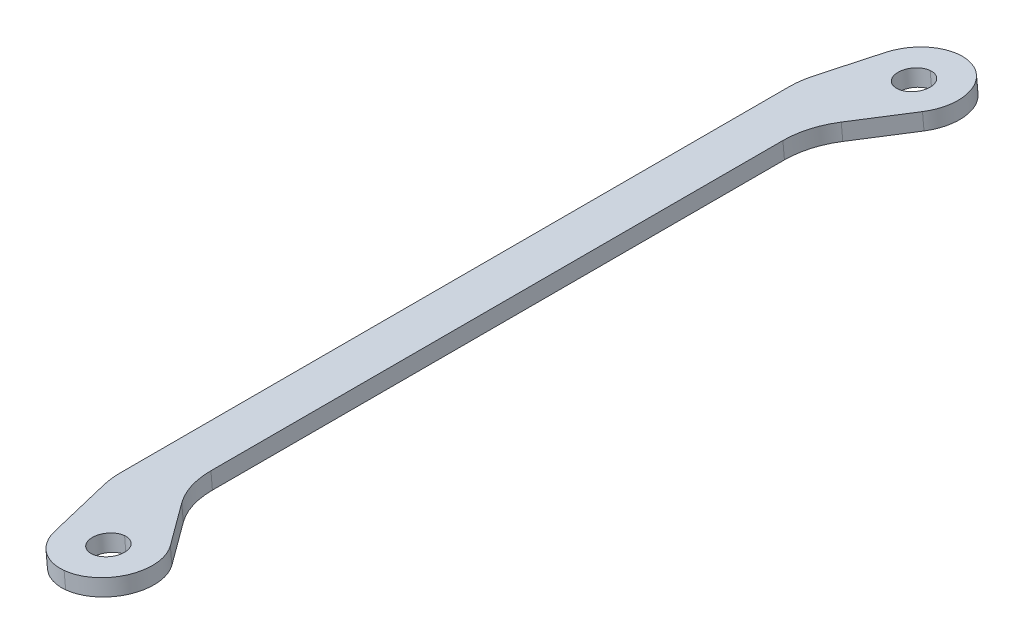
ISO-10303-21;
HEADER;
FILE_DESCRIPTION(('STEP AP214'),'2;1');
FILE_NAME('part.step','',(''),(''),'','','');
FILE_SCHEMA(('AUTOMOTIVE_DESIGN { 1 0 10303 214 1 1 1 1 }'));
ENDSEC;
DATA;
#1=APPLICATION_CONTEXT('core data for automotive mechanical design processes');
#2=APPLICATION_PROTOCOL_DEFINITION('international standard','automotive_design',2000,#1);
#3=PRODUCT_CONTEXT('',#1,'mechanical');
#4=PRODUCT('Part','Part','',(#3));
#5=PRODUCT_RELATED_PRODUCT_CATEGORY('part','',(#4));
#6=PRODUCT_DEFINITION_FORMATION('','',#4);
#7=PRODUCT_DEFINITION_CONTEXT('part definition',#1,'design');
#8=PRODUCT_DEFINITION('design','',#6,#7);
#9=PRODUCT_DEFINITION_SHAPE('','',#8);
#10=(LENGTH_UNIT() NAMED_UNIT(*) SI_UNIT(.MILLI.,.METRE.));
#11=(NAMED_UNIT(*) PLANE_ANGLE_UNIT() SI_UNIT($,.RADIAN.));
#12=(NAMED_UNIT(*) SI_UNIT($,.STERADIAN.) SOLID_ANGLE_UNIT());
#13=UNCERTAINTY_MEASURE_WITH_UNIT(LENGTH_MEASURE(1.E-05),#10,'distance_accuracy_value','');
#14=(GEOMETRIC_REPRESENTATION_CONTEXT(3) GLOBAL_UNCERTAINTY_ASSIGNED_CONTEXT((#13)) GLOBAL_UNIT_ASSIGNED_CONTEXT((#10,
#11,#12)) REPRESENTATION_CONTEXT('',''));
#15=CARTESIAN_POINT('',(0.,0.,0.));
#16=DIRECTION('',(0.,0.,1.));
#17=DIRECTION('',(1.,0.,0.));
#18=AXIS2_PLACEMENT_3D('',#15,#16,#17);
#19=CARTESIAN_POINT('',(104.497536528695,0.153229858228063,83.5835921350063));
#20=DIRECTION('',(0.0958457525245035,-0.995396198366767,0.));
#21=DIRECTION('',(0.,0.,-1.));
#22=AXIS2_PLACEMENT_3D('',#19,#20,#21);
#23=PLANE('',#22);
#24=CARTESIAN_POINT('',(102.086853849795,-0.0788924824399744,-97.9999999999974));
#25=DIRECTION('',(0.0958457525245035,-0.995396198366767,0.));
#26=DIRECTION('',(1.00613961606655E-12,0.,-1.));
#27=AXIS2_PLACEMENT_3D('',#24,#25,#26);
#28=CIRCLE('',#27,4.);
#29=CARTESIAN_POINT('',(102.086853849791,-0.0788924824403613,-93.9999999999974));
#30=VERTEX_POINT('',#29);
#31=CARTESIAN_POINT('',(102.086853849799,-0.0788924824395868,-101.999999999997));
#32=VERTEX_POINT('',#31);
#33=EDGE_CURVE('E257',#30,#32,#28,.T.);
#34=ORIENTED_EDGE('',*,*,#33,.T.);
#35=CARTESIAN_POINT('',(102.086853849795,-0.0788924824399744,-97.9999999999974));
#36=DIRECTION('',(0.0958457525245035,-0.995396198366767,0.));
#37=DIRECTION('',(1.00613961606655E-12,0.,-1.));
#38=AXIS2_PLACEMENT_3D('',#35,#36,#37);
#39=CIRCLE('',#38,4.);
#40=EDGE_CURVE('E11',#32,#30,#39,.T.);
#41=ORIENTED_EDGE('',*,*,#40,.T.);
#42=EDGE_LOOP('',(#34,#41));
#43=FACE_BOUND('',#42,.T.);
#44=CARTESIAN_POINT('',(102.086853849594,-0.07889248245932,102.000000000003));
#45=DIRECTION('',(0.0958457525245035,-0.995396198366767,0.));
#46=DIRECTION('',(1.00613961606655E-12,0.,-1.));
#47=AXIS2_PLACEMENT_3D('',#44,#45,#46);
#48=CIRCLE('',#47,4.);
#49=CARTESIAN_POINT('',(102.08685384959,-0.0788924824597069,106.000000000003));
#50=VERTEX_POINT('',#49);
#51=CARTESIAN_POINT('',(102.086853849598,-0.0788924824589323,98.0000000000026));
#52=VERTEX_POINT('',#51);
#53=EDGE_CURVE('E271',#50,#52,#48,.T.);
#54=ORIENTED_EDGE('',*,*,#53,.T.);
#55=CARTESIAN_POINT('',(102.086853849594,-0.07889248245932,102.000000000003));
#56=DIRECTION('',(0.0958457525245035,-0.995396198366767,0.));
#57=DIRECTION('',(1.00613961606655E-12,0.,-1.));
#58=AXIS2_PLACEMENT_3D('',#55,#56,#57);
#59=CIRCLE('',#58,4.);
#60=EDGE_CURVE('E280',#52,#50,#59,.T.);
#61=ORIENTED_EDGE('',*,*,#60,.T.);
#62=EDGE_LOOP('',(#54,#61));
#63=FACE_BOUND('',#62,.T.);
#64=DIRECTION('',(-0.251701332881661,-0.0242360817743192,-0.967501447733193));
#65=VECTOR('',#64,1.);
#66=CARTESIAN_POINT('',(91.4933339567267,-1.0989324300512,104.781520229074));
#67=LINE('',#66,#65);
#68=CARTESIAN_POINT('',(91.4933339567267,-1.0989324300512,104.781520229074));
#69=VERTEX_POINT('',#68);
#70=CARTESIAN_POINT('',(87.1626857949118,-1.51592641964956,88.1351706916692));
#71=VERTEX_POINT('',#70);
#72=EDGE_CURVE('E261',#69,#71,#67,.T.);
#73=ORIENTED_EDGE('',*,*,#72,.F.);
#74=CARTESIAN_POINT('',(102.086853849594,-0.07889248245932,102.000000000003));
#75=DIRECTION('',(0.0958457525245035,-0.995396198366767,0.));
#76=DIRECTION('',(1.00424719045639E-12,0.,-1.));
#77=AXIS2_PLACEMENT_3D('',#74,#75,#76);
#78=CIRCLE('',#77,11.);
#79=CARTESIAN_POINT('',(102.086853849583,-0.0788924824603834,113.000000000003));
#80=VERTEX_POINT('',#79);
#81=EDGE_CURVE('E249',#80,#69,#78,.T.);
#82=ORIENTED_EDGE('',*,*,#81,.F.);
#83=CARTESIAN_POINT('',(102.086853849594,-0.07889248245932,102.000000000003));
#84=DIRECTION('',(0.0958457525245035,-0.995396198366767,0.));
#85=DIRECTION('',(1.00424719045639E-12,0.,-1.));
#86=AXIS2_PLACEMENT_3D('',#83,#84,#85);
#87=CIRCLE('',#86,11.);
#88=CARTESIAN_POINT('',(110.817895533223,0.761811211068184,95.3620689655287));
#89=VERTEX_POINT('',#88);
#90=EDGE_CURVE('E240',#89,#80,#87,.T.);
#91=ORIENTED_EDGE('',*,*,#90,.F.);
#92=DIRECTION('',(0.600670119703283,0.0578379541095371,0.797402143438345));
#93=VECTOR('',#92,1.);
#94=CARTESIAN_POINT('',(102.155131790442,-0.0723180645218718,83.86206896552));
#95=LINE('',#94,#93);
#96=CARTESIAN_POINT('',(102.155131790431,-0.0723180645229111,83.8620689655056));
#97=VERTEX_POINT('',#96);
#98=EDGE_CURVE('E323',#97,#89,#95,.T.);
#99=ORIENTED_EDGE('',*,*,#98,.F.);
#100=CARTESIAN_POINT('',(116.442290909107,1.30337888852313,73.0000000000172));
#101=DIRECTION('',(-0.0958457525245036,0.995396198366767,0.));
#102=DIRECTION('',(1.00459763964346E-12,0.,-1.));
#103=AXIS2_PLACEMENT_3D('',#100,#101,#102);
#104=CIRCLE('',#103,18.);
#105=CARTESIAN_POINT('',(98.5251593385052,-0.42184465691793,72.999999999999));
#106=VERTEX_POINT('',#105);
#107=EDGE_CURVE('E312',#106,#97,#104,.T.);
#108=ORIENTED_EDGE('',*,*,#107,.F.);
#109=DIRECTION('',(-1.00455392664097E-12,0.,1.));
#110=VECTOR('',#109,1.);
#111=CARTESIAN_POINT('',(98.5251593386479,-0.421844656904195,-69.000000000001));
#112=LINE('',#111,#110);
#113=CARTESIAN_POINT('',(98.5251593386479,-0.421844656904195,-69.000000000001));
#114=VERTEX_POINT('',#113);
#115=EDGE_CURVE('E235',#114,#106,#112,.T.);
#116=ORIENTED_EDGE('',*,*,#115,.F.);
#117=CARTESIAN_POINT('',(116.44229090925,1.30337888853687,-68.9999999999828));
#118=DIRECTION('',(-0.0958457525245036,0.995396198366767,0.));
#119=DIRECTION('',(1.00459763964346E-12,0.,-1.));
#120=AXIS2_PLACEMENT_3D('',#117,#118,#119);
#121=CIRCLE('',#120,18.);
#122=CARTESIAN_POINT('',(102.155131790607,-0.0723180645060345,-79.8620689655143));
#123=VERTEX_POINT('',#122);
#124=EDGE_CURVE('E125',#123,#114,#121,.T.);
#125=ORIENTED_EDGE('',*,*,#124,.F.);
#126=DIRECTION('',(-0.600670119704884,-0.0578379541096913,0.797402143437128));
#127=VECTOR('',#126,1.);
#128=CARTESIAN_POINT('',(110.81789553341,0.761811211086245,-91.362068965506));
#129=LINE('',#128,#127);
#130=CARTESIAN_POINT('',(110.81789553341,0.761811211086245,-91.362068965506));
#131=VERTEX_POINT('',#130);
#132=EDGE_CURVE('E297',#131,#123,#129,.T.);
#133=ORIENTED_EDGE('',*,*,#132,.F.);
#134=CARTESIAN_POINT('',(102.086853849795,-0.0788924824399744,-97.9999999999974));
#135=DIRECTION('',(0.0958457525245035,-0.995396198366767,0.));
#136=DIRECTION('',(1.00424719045639E-12,0.,-1.));
#137=AXIS2_PLACEMENT_3D('',#134,#135,#136);
#138=CIRCLE('',#137,11.);
#139=CARTESIAN_POINT('',(91.6452398300988,-1.08430555808792,-101.310867138829));
#140=VERTEX_POINT('',#139);
#141=EDGE_CURVE('E230',#140,#131,#138,.T.);
#142=ORIENTED_EDGE('',*,*,#141,.F.);
#143=DIRECTION('',(0.299602233026428,0.028848413857272,-0.953627952077485));
#144=VECTOR('',#143,1.);
#145=CARTESIAN_POINT('',(87.4112590420861,-1.49199153827069,-87.8341904558092));
#146=LINE('',#145,#144);
#147=CARTESIAN_POINT('',(87.4112590420861,-1.49199153827069,-87.8341904558092));
#148=VERTEX_POINT('',#147);
#149=EDGE_CURVE('E229',#148,#140,#146,.T.);
#150=ORIENTED_EDGE('',*,*,#149,.F.);
#151=CARTESIAN_POINT('',(104.497536528862,0.153229858244125,-82.4164078649939));
#152=DIRECTION('',(0.0958457525245036,-0.995396198366767,0.));
#153=DIRECTION('',(1.00459763964346E-12,0.,-1.));
#154=AXIS2_PLACEMENT_3D('',#151,#152,#153);
#155=CIRCLE('',#154,18.);
#156=CARTESIAN_POINT('',(86.5804049582602,-1.57199368719694,-82.4164078650121));
#157=VERTEX_POINT('',#156);
#158=EDGE_CURVE('E199',#157,#148,#155,.T.);
#159=ORIENTED_EDGE('',*,*,#158,.F.);
#160=DIRECTION('',(1.00455696667117E-12,0.,-1.));
#161=VECTOR('',#160,1.);
#162=CARTESIAN_POINT('',(86.5804049580934,-1.57199368721299,83.5835921349882));
#163=LINE('',#162,#161);
#164=CARTESIAN_POINT('',(86.5804049580933,-1.571993687213,83.5835921349882));
#165=VERTEX_POINT('',#164);
#166=EDGE_CURVE('E210',#165,#157,#163,.T.);
#167=ORIENTED_EDGE('',*,*,#166,.F.);
#168=CARTESIAN_POINT('',(104.497536528695,0.153229858228063,83.5835921350063));
#169=DIRECTION('',(0.0958457525245036,-0.995396198366767,0.));
#170=DIRECTION('',(1.00459763964346E-12,0.,-1.));
#171=AXIS2_PLACEMENT_3D('',#168,#169,#170);
#172=CIRCLE('',#171,18.);
#173=EDGE_CURVE('E213',#71,#165,#172,.T.);
#174=ORIENTED_EDGE('',*,*,#173,.F.);
#175=EDGE_LOOP('',(#73,#82,#91,#99,#108,#116,#125,#133,#142,#150,#159,#167,#174));
#176=FACE_BOUND('',#175,.T.);
#177=ADVANCED_FACE('F16',(#43,#63,#176),#23,.F.);
#178=CARTESIAN_POINT('',(104.880919538793,-3.828354935239,83.5835921350063));
#179=DIRECTION('',(0.0958457525245035,-0.995396198366767,0.));
#180=DIRECTION('',(0.,0.,-1.));
#181=AXIS2_PLACEMENT_3D('',#178,#179,#180);
#182=PLANE('',#181);
#183=CARTESIAN_POINT('',(102.470236859893,-4.06047727590704,-97.9999999999974));
#184=DIRECTION('',(0.0958457525245035,-0.995396198366767,0.));
#185=DIRECTION('',(1.00613961606655E-12,0.,-1.));
#186=AXIS2_PLACEMENT_3D('',#183,#184,#185);
#187=CIRCLE('',#186,4.);
#188=CARTESIAN_POINT('',(102.470236859889,-4.06047727590743,-93.9999999999974));
#189=VERTEX_POINT('',#188);
#190=CARTESIAN_POINT('',(102.470236859897,-4.06047727590666,-101.999999999997));
#191=VERTEX_POINT('',#190);
#192=EDGE_CURVE('E20',#189,#191,#187,.T.);
#193=ORIENTED_EDGE('',*,*,#192,.F.);
#194=CARTESIAN_POINT('',(102.470236859893,-4.06047727590704,-97.9999999999974));
#195=DIRECTION('',(0.0958457525245035,-0.995396198366767,0.));
#196=DIRECTION('',(1.00613961606655E-12,0.,-1.));
#197=AXIS2_PLACEMENT_3D('',#194,#195,#196);
#198=CIRCLE('',#197,4.);
#199=EDGE_CURVE('E27',#191,#189,#198,.T.);
#200=ORIENTED_EDGE('',*,*,#199,.F.);
#201=EDGE_LOOP('',(#193,#200));
#202=FACE_BOUND('',#201,.T.);
#203=CARTESIAN_POINT('',(102.470236859692,-4.06047727592639,102.000000000003));
#204=DIRECTION('',(0.0958457525245035,-0.995396198366767,0.));
#205=DIRECTION('',(1.00613961606655E-12,0.,-1.));
#206=AXIS2_PLACEMENT_3D('',#203,#204,#205);
#207=CIRCLE('',#206,4.);
#208=CARTESIAN_POINT('',(102.470236859688,-4.06047727592677,106.000000000003));
#209=VERTEX_POINT('',#208);
#210=CARTESIAN_POINT('',(102.470236859696,-4.060477275926,98.0000000000026));
#211=VERTEX_POINT('',#210);
#212=EDGE_CURVE('E288',#209,#211,#207,.T.);
#213=ORIENTED_EDGE('',*,*,#212,.F.);
#214=CARTESIAN_POINT('',(102.470236859692,-4.06047727592639,102.000000000003));
#215=DIRECTION('',(0.0958457525245035,-0.995396198366767,0.));
#216=DIRECTION('',(1.00613961606655E-12,0.,-1.));
#217=AXIS2_PLACEMENT_3D('',#214,#215,#216);
#218=CIRCLE('',#217,4.);
#219=EDGE_CURVE('E277',#211,#209,#218,.T.);
#220=ORIENTED_EDGE('',*,*,#219,.F.);
#221=EDGE_LOOP('',(#213,#220));
#222=FACE_BOUND('',#221,.T.);
#223=DIRECTION('',(-0.251701332881661,-0.0242360817743192,-0.967501447733193));
#224=VECTOR('',#223,1.);
#225=CARTESIAN_POINT('',(91.8767169668246,-5.08051722351827,104.781520229074));
#226=LINE('',#225,#224);
#227=CARTESIAN_POINT('',(91.8767169668246,-5.08051722351827,104.781520229074));
#228=VERTEX_POINT('',#227);
#229=CARTESIAN_POINT('',(87.5460688050098,-5.49751121311663,88.1351706916692));
#230=VERTEX_POINT('',#229);
#231=EDGE_CURVE('E205',#228,#230,#226,.T.);
#232=ORIENTED_EDGE('',*,*,#231,.T.);
#233=CARTESIAN_POINT('',(104.880919538793,-3.828354935239,83.5835921350063));
#234=DIRECTION('',(0.0958457525245036,-0.995396198366767,0.));
#235=DIRECTION('',(1.00459763964346E-12,0.,-1.));
#236=AXIS2_PLACEMENT_3D('',#233,#234,#235);
#237=CIRCLE('',#236,18.);
#238=CARTESIAN_POINT('',(86.9637879681914,-5.55357848068007,83.5835921349882));
#239=VERTEX_POINT('',#238);
#240=EDGE_CURVE('E202',#230,#239,#237,.T.);
#241=ORIENTED_EDGE('',*,*,#240,.T.);
#242=DIRECTION('',(1.00455696667117E-12,0.,-1.));
#243=VECTOR('',#242,1.);
#244=CARTESIAN_POINT('',(86.9637879681914,-5.55357848068006,83.5835921349882));
#245=LINE('',#244,#243);
#246=CARTESIAN_POINT('',(86.9637879683582,-5.553578480664,-82.4164078650121));
#247=VERTEX_POINT('',#246);
#248=EDGE_CURVE('E187',#239,#247,#245,.T.);
#249=ORIENTED_EDGE('',*,*,#248,.T.);
#250=CARTESIAN_POINT('',(104.88091953896,-3.82835493522294,-82.4164078649939));
#251=DIRECTION('',(0.0958457525245036,-0.995396198366767,0.));
#252=DIRECTION('',(1.00459763964346E-12,0.,-1.));
#253=AXIS2_PLACEMENT_3D('',#250,#251,#252);
#254=CIRCLE('',#253,18.);
#255=CARTESIAN_POINT('',(87.7946420521842,-5.47357633173776,-87.8341904558092));
#256=VERTEX_POINT('',#255);
#257=EDGE_CURVE('E316',#247,#256,#254,.T.);
#258=ORIENTED_EDGE('',*,*,#257,.T.);
#259=DIRECTION('',(0.299602233026428,0.028848413857272,-0.953627952077485));
#260=VECTOR('',#259,1.);
#261=CARTESIAN_POINT('',(87.7946420521842,-5.47357633173776,-87.8341904558092));
#262=LINE('',#261,#260);
#263=CARTESIAN_POINT('',(92.0286228401968,-5.06589035155499,-101.310867138829));
#264=VERTEX_POINT('',#263);
#265=EDGE_CURVE('E228',#256,#264,#262,.T.);
#266=ORIENTED_EDGE('',*,*,#265,.T.);
#267=CARTESIAN_POINT('',(102.470236859893,-4.06047727590704,-97.9999999999974));
#268=DIRECTION('',(0.0958457525245035,-0.995396198366767,0.));
#269=DIRECTION('',(1.00424719045639E-12,0.,-1.));
#270=AXIS2_PLACEMENT_3D('',#267,#268,#269);
#271=CIRCLE('',#270,11.);
#272=CARTESIAN_POINT('',(111.201278543508,-3.21977358238082,-91.362068965506));
#273=VERTEX_POINT('',#272);
#274=EDGE_CURVE('E293',#264,#273,#271,.T.);
#275=ORIENTED_EDGE('',*,*,#274,.T.);
#276=DIRECTION('',(-0.600670119704884,-0.0578379541096913,0.797402143437128));
#277=VECTOR('',#276,1.);
#278=CARTESIAN_POINT('',(111.201278543508,-3.21977358238082,-91.362068965506));
#279=LINE('',#278,#277);
#280=CARTESIAN_POINT('',(102.538514800705,-4.0539028579731,-79.8620689655143));
#281=VERTEX_POINT('',#280);
#282=EDGE_CURVE('E346',#273,#281,#279,.T.);
#283=ORIENTED_EDGE('',*,*,#282,.T.);
#284=CARTESIAN_POINT('',(116.825673919348,-2.6782059049302,-68.9999999999828));
#285=DIRECTION('',(-0.0958457525245036,0.995396198366767,0.));
#286=DIRECTION('',(1.00459763964346E-12,0.,-1.));
#287=AXIS2_PLACEMENT_3D('',#284,#285,#286);
#288=CIRCLE('',#287,18.);
#289=CARTESIAN_POINT('',(98.9085423487459,-4.40342945037126,-69.000000000001));
#290=VERTEX_POINT('',#289);
#291=EDGE_CURVE('E113',#281,#290,#288,.T.);
#292=ORIENTED_EDGE('',*,*,#291,.T.);
#293=DIRECTION('',(-1.00455392664097E-12,0.,1.));
#294=VECTOR('',#293,1.);
#295=CARTESIAN_POINT('',(98.9085423487459,-4.40342945037126,-69.000000000001));
#296=LINE('',#295,#294);
#297=CARTESIAN_POINT('',(98.9085423486033,-4.403429450385,72.999999999999));
#298=VERTEX_POINT('',#297);
#299=EDGE_CURVE('E292',#290,#298,#296,.T.);
#300=ORIENTED_EDGE('',*,*,#299,.T.);
#301=CARTESIAN_POINT('',(116.825673919205,-2.67820590494393,73.0000000000172));
#302=DIRECTION('',(-0.0958457525245036,0.995396198366767,0.));
#303=DIRECTION('',(1.00459763964346E-12,0.,-1.));
#304=AXIS2_PLACEMENT_3D('',#301,#302,#303);
#305=CIRCLE('',#304,18.);
#306=CARTESIAN_POINT('',(102.538514800529,-4.05390285798998,83.8620689655056));
#307=VERTEX_POINT('',#306);
#308=EDGE_CURVE('E311',#298,#307,#305,.T.);
#309=ORIENTED_EDGE('',*,*,#308,.T.);
#310=DIRECTION('',(0.600670119703283,0.0578379541095371,0.797402143438345));
#311=VECTOR('',#310,1.);
#312=CARTESIAN_POINT('',(102.53851480054,-4.05390285798894,83.86206896552));
#313=LINE('',#312,#311);
#314=CARTESIAN_POINT('',(111.201278543321,-3.21977358239888,95.3620689655287));
#315=VERTEX_POINT('',#314);
#316=EDGE_CURVE('E223',#307,#315,#313,.T.);
#317=ORIENTED_EDGE('',*,*,#316,.T.);
#318=CARTESIAN_POINT('',(102.470236859692,-4.06047727592639,102.000000000003));
#319=DIRECTION('',(0.0958457525245035,-0.995396198366767,0.));
#320=DIRECTION('',(1.00424719045639E-12,0.,-1.));
#321=AXIS2_PLACEMENT_3D('',#318,#319,#320);
#322=CIRCLE('',#321,11.);
#323=CARTESIAN_POINT('',(102.470236859681,-4.06047727592745,113.000000000003));
#324=VERTEX_POINT('',#323);
#325=EDGE_CURVE('E42',#315,#324,#322,.T.);
#326=ORIENTED_EDGE('',*,*,#325,.T.);
#327=CARTESIAN_POINT('',(102.470236859692,-4.06047727592639,102.000000000003));
#328=DIRECTION('',(0.0958457525245035,-0.995396198366767,0.));
#329=DIRECTION('',(1.00424719045639E-12,0.,-1.));
#330=AXIS2_PLACEMENT_3D('',#327,#328,#329);
#331=CIRCLE('',#330,11.);
#332=EDGE_CURVE('E250',#324,#228,#331,.T.);
#333=ORIENTED_EDGE('',*,*,#332,.T.);
#334=EDGE_LOOP('',(#232,#241,#249,#258,#266,#275,#283,#292,#300,#309,#317,#326,#333));
#335=FACE_BOUND('',#334,.T.);
#336=ADVANCED_FACE('F203',(#202,#222,#335),#182,.T.);
#337=CARTESIAN_POINT('',(102.470236859893,-4.06047727590704,-97.9999999999974));
#338=DIRECTION('',(-0.0958457525245035,0.995396198366767,0.));
#339=DIRECTION('',(-1.00613961606655E-12,0.,1.));
#340=AXIS2_PLACEMENT_3D('',#337,#338,#339);
#341=CYLINDRICAL_SURFACE('',#340,4.);
#342=DIRECTION('',(-0.0958457525245036,0.995396198366767,0.));
#343=VECTOR('',#342,1.);
#344=CARTESIAN_POINT('',(102.470236859897,-4.06047727590666,-101.999999999997));
#345=LINE('',#344,#343);
#346=EDGE_CURVE('E253',#191,#32,#345,.T.);
#347=ORIENTED_EDGE('',*,*,#346,.F.);
#348=ORIENTED_EDGE('',*,*,#199,.T.);
#349=DIRECTION('',(-0.0958457525245036,0.995396198366767,0.));
#350=VECTOR('',#349,1.);
#351=CARTESIAN_POINT('',(102.470236859889,-4.06047727590743,-93.9999999999974));
#352=LINE('',#351,#350);
#353=EDGE_CURVE('E339',#189,#30,#352,.T.);
#354=ORIENTED_EDGE('',*,*,#353,.T.);
#355=ORIENTED_EDGE('',*,*,#40,.F.);
#356=EDGE_LOOP('',(#347,#348,#354,#355));
#357=FACE_BOUND('',#356,.T.);
#358=ADVANCED_FACE('F434',(#357),#341,.F.);
#359=CARTESIAN_POINT('',(102.470236859692,-4.06047727592639,102.000000000003));
#360=DIRECTION('',(-0.0958457525245035,0.995396198366767,0.));
#361=DIRECTION('',(-1.00424719045639E-12,0.,1.));
#362=AXIS2_PLACEMENT_3D('',#359,#360,#361);
#363=CYLINDRICAL_SURFACE('',#362,11.);
#364=DIRECTION('',(-0.0958457525245036,0.995396198366767,0.));
#365=VECTOR('',#364,1.);
#366=CARTESIAN_POINT('',(102.470236859681,-4.06047727592745,113.000000000003));
#367=LINE('',#366,#365);
#368=EDGE_CURVE('E245',#324,#80,#367,.T.);
#369=ORIENTED_EDGE('',*,*,#368,.F.);
#370=ORIENTED_EDGE('',*,*,#325,.F.);
#371=DIRECTION('',(-0.0958457525245036,0.995396198366767,0.));
#372=VECTOR('',#371,1.);
#373=CARTESIAN_POINT('',(111.201278543321,-3.21977358239888,95.3620689655287));
#374=LINE('',#373,#372);
#375=EDGE_CURVE('E330',#315,#89,#374,.T.);
#376=ORIENTED_EDGE('',*,*,#375,.T.);
#377=ORIENTED_EDGE('',*,*,#90,.T.);
#378=EDGE_LOOP('',(#369,#370,#376,#377));
#379=FACE_BOUND('',#378,.T.);
#380=ADVANCED_FACE('F382',(#379),#363,.T.);
#381=CARTESIAN_POINT('',(102.470236859692,-4.06047727592639,102.000000000003));
#382=DIRECTION('',(-0.0958457525245035,0.995396198366767,0.));
#383=DIRECTION('',(-1.00613961606655E-12,0.,1.));
#384=AXIS2_PLACEMENT_3D('',#381,#382,#383);
#385=CYLINDRICAL_SURFACE('',#384,4.);
#386=DIRECTION('',(-0.0958457525245036,0.995396198366767,0.));
#387=VECTOR('',#386,1.);
#388=CARTESIAN_POINT('',(102.470236859696,-4.060477275926,98.0000000000026));
#389=LINE('',#388,#387);
#390=EDGE_CURVE('E276',#211,#52,#389,.T.);
#391=ORIENTED_EDGE('',*,*,#390,.F.);
#392=ORIENTED_EDGE('',*,*,#219,.T.);
#393=DIRECTION('',(-0.0958457525245036,0.995396198366767,0.));
#394=VECTOR('',#393,1.);
#395=CARTESIAN_POINT('',(102.470236859688,-4.06047727592677,106.000000000003));
#396=LINE('',#395,#394);
#397=EDGE_CURVE('E275',#209,#50,#396,.T.);
#398=ORIENTED_EDGE('',*,*,#397,.T.);
#399=ORIENTED_EDGE('',*,*,#60,.F.);
#400=EDGE_LOOP('',(#391,#392,#398,#399));
#401=FACE_BOUND('',#400,.T.);
#402=ADVANCED_FACE('F427',(#401),#385,.F.);
#403=CARTESIAN_POINT('',(102.53851480054,-4.05390285798894,83.86206896552));
#404=DIRECTION('',(-0.79373106214804,-0.0764276085025004,0.603448275861265));
#405=DIRECTION('',(-0.0958457525245036,0.995396198366767,0.));
#406=AXIS2_PLACEMENT_3D('',#403,#404,#405);
#407=PLANE('',#406);
#408=ORIENTED_EDGE('',*,*,#98,.T.);
#409=ORIENTED_EDGE('',*,*,#375,.F.);
#410=ORIENTED_EDGE('',*,*,#316,.F.);
#411=DIRECTION('',(-0.0958457525245036,0.995396198366767,0.));
#412=VECTOR('',#411,1.);
#413=CARTESIAN_POINT('',(102.538514800529,-4.05390285798998,83.8620689655056));
#414=LINE('',#413,#412);
#415=EDGE_CURVE('E307',#307,#97,#414,.T.);
#416=ORIENTED_EDGE('',*,*,#415,.T.);
#417=EDGE_LOOP('',(#408,#409,#410,#416));
#418=FACE_BOUND('',#417,.T.);
#419=ADVANCED_FACE('F380',(#418),#407,.F.);
#420=CARTESIAN_POINT('',(116.825673919205,-2.67820590494393,73.0000000000172));
#421=DIRECTION('',(-0.0958457525245036,0.995396198366767,0.));
#422=DIRECTION('',(-1.00459763964346E-12,0.,1.));
#423=AXIS2_PLACEMENT_3D('',#420,#421,#422);
#424=CYLINDRICAL_SURFACE('',#423,18.);
#425=ORIENTED_EDGE('',*,*,#107,.T.);
#426=ORIENTED_EDGE('',*,*,#415,.F.);
#427=ORIENTED_EDGE('',*,*,#308,.F.);
#428=DIRECTION('',(-0.0958457525245036,0.995396198366767,0.));
#429=VECTOR('',#428,1.);
#430=CARTESIAN_POINT('',(98.9085423486033,-4.403429450385,72.999999999999));
#431=LINE('',#430,#429);
#432=EDGE_CURVE('E239',#298,#106,#431,.T.);
#433=ORIENTED_EDGE('',*,*,#432,.T.);
#434=EDGE_LOOP('',(#425,#426,#427,#433));
#435=FACE_BOUND('',#434,.T.);
#436=ADVANCED_FACE('F417',(#435),#424,.F.);
#437=CARTESIAN_POINT('',(98.9085423487459,-4.40342945037126,-69.000000000001));
#438=DIRECTION('',(-0.995396198366767,-0.0958457525245035,-1.00920008363451E-12));
#439=DIRECTION('',(-0.0958457525245035,0.995396198366767,0.));
#440=AXIS2_PLACEMENT_3D('',#437,#438,#439);
#441=PLANE('',#440);
#442=ORIENTED_EDGE('',*,*,#115,.T.);
#443=ORIENTED_EDGE('',*,*,#432,.F.);
#444=ORIENTED_EDGE('',*,*,#299,.F.);
#445=DIRECTION('',(-0.0958457525245036,0.995396198366767,0.));
#446=VECTOR('',#445,1.);
#447=CARTESIAN_POINT('',(98.9085423487459,-4.40342945037126,-69.000000000001));
#448=LINE('',#447,#446);
#449=EDGE_CURVE('E266',#290,#114,#448,.T.);
#450=ORIENTED_EDGE('',*,*,#449,.T.);
#451=EDGE_LOOP('',(#442,#443,#444,#450));
#452=FACE_BOUND('',#451,.T.);
#453=ADVANCED_FACE('F415',(#452),#441,.F.);
#454=CARTESIAN_POINT('',(116.825673919348,-2.6782059049302,-68.9999999999828));
#455=DIRECTION('',(-0.0958457525245036,0.995396198366767,0.));
#456=DIRECTION('',(-1.00459763964346E-12,0.,1.));
#457=AXIS2_PLACEMENT_3D('',#454,#455,#456);
#458=CYLINDRICAL_SURFACE('',#457,18.);
#459=ORIENTED_EDGE('',*,*,#124,.T.);
#460=ORIENTED_EDGE('',*,*,#449,.F.);
#461=ORIENTED_EDGE('',*,*,#291,.F.);
#462=DIRECTION('',(-0.0958457525245036,0.995396198366767,0.));
#463=VECTOR('',#462,1.);
#464=CARTESIAN_POINT('',(102.538514800705,-4.0539028579731,-79.8620689655143));
#465=LINE('',#464,#463);
#466=EDGE_CURVE('E343',#281,#123,#465,.T.);
#467=ORIENTED_EDGE('',*,*,#466,.T.);
#468=EDGE_LOOP('',(#459,#460,#461,#467));
#469=FACE_BOUND('',#468,.T.);
#470=ADVANCED_FACE('F425',(#469),#458,.F.);
#471=CARTESIAN_POINT('',(111.201278543508,-3.21977358238082,-91.362068965506));
#472=DIRECTION('',(-0.793731062146828,-0.0764276085023836,-0.603448275862874));
#473=DIRECTION('',(-0.605218459419788,0.,0.796059430179392));
#474=AXIS2_PLACEMENT_3D('',#471,#472,#473);
#475=PLANE('',#474);
#476=ORIENTED_EDGE('',*,*,#132,.T.);
#477=ORIENTED_EDGE('',*,*,#466,.F.);
#478=ORIENTED_EDGE('',*,*,#282,.F.);
#479=DIRECTION('',(-0.0958457525245036,0.995396198366767,0.));
#480=VECTOR('',#479,1.);
#481=CARTESIAN_POINT('',(111.201278543508,-3.21977358238082,-91.362068965506));
#482=LINE('',#481,#480);
#483=EDGE_CURVE('E234',#273,#131,#482,.T.);
#484=ORIENTED_EDGE('',*,*,#483,.T.);
#485=EDGE_LOOP('',(#476,#477,#478,#484));
#486=FACE_BOUND('',#485,.T.);
#487=ADVANCED_FACE('F447',(#486),#475,.F.);
#488=CARTESIAN_POINT('',(102.470236859893,-4.06047727590704,-97.9999999999974));
#489=DIRECTION('',(-0.0958457525245035,0.995396198366767,0.));
#490=DIRECTION('',(-1.00424719045639E-12,0.,1.));
#491=AXIS2_PLACEMENT_3D('',#488,#489,#490);
#492=CYLINDRICAL_SURFACE('',#491,11.);
#493=ORIENTED_EDGE('',*,*,#141,.T.);
#494=ORIENTED_EDGE('',*,*,#483,.F.);
#495=ORIENTED_EDGE('',*,*,#274,.F.);
#496=DIRECTION('',(-0.0958457525245036,0.995396198366767,0.));
#497=VECTOR('',#496,1.);
#498=CARTESIAN_POINT('',(92.0286228401968,-5.06589035155499,-101.310867138829));
#499=LINE('',#498,#497);
#500=EDGE_CURVE('E224',#264,#140,#499,.T.);
#501=ORIENTED_EDGE('',*,*,#500,.T.);
#502=EDGE_LOOP('',(#493,#494,#495,#501));
#503=FACE_BOUND('',#502,.T.);
#504=ADVANCED_FACE('F444',(#503),#492,.T.);
#505=CARTESIAN_POINT('',(87.7946420521842,-5.47357633173776,-87.8341904558092));
#506=DIRECTION('',(0.949237638154214,0.0914011886952678,0.300987921711989));
#507=DIRECTION('',(0.,-0.956854191482655,0.290568505248031));
#508=AXIS2_PLACEMENT_3D('',#505,#506,#507);
#509=PLANE('',#508);
#510=ORIENTED_EDGE('',*,*,#149,.T.);
#511=ORIENTED_EDGE('',*,*,#500,.F.);
#512=ORIENTED_EDGE('',*,*,#265,.F.);
#513=DIRECTION('',(-0.0958457525245036,0.995396198366767,0.));
#514=VECTOR('',#513,1.);
#515=CARTESIAN_POINT('',(87.7946420521842,-5.47357633173776,-87.8341904558092));
#516=LINE('',#515,#514);
#517=EDGE_CURVE('E306',#256,#148,#516,.T.);
#518=ORIENTED_EDGE('',*,*,#517,.T.);
#519=EDGE_LOOP('',(#510,#511,#512,#518));
#520=FACE_BOUND('',#519,.T.);
#521=ADVANCED_FACE('F441',(#520),#509,.F.);
#522=CARTESIAN_POINT('',(104.88091953896,-3.82835493522294,-82.4164078649939));
#523=DIRECTION('',(-0.0958457525245036,0.995396198366767,0.));
#524=DIRECTION('',(-1.00459763964346E-12,0.,1.));
#525=AXIS2_PLACEMENT_3D('',#522,#523,#524);
#526=CYLINDRICAL_SURFACE('',#525,18.);
#527=ORIENTED_EDGE('',*,*,#158,.T.);
#528=ORIENTED_EDGE('',*,*,#517,.F.);
#529=ORIENTED_EDGE('',*,*,#257,.F.);
#530=DIRECTION('',(-0.0958457525245036,0.995396198366767,0.));
#531=VECTOR('',#530,1.);
#532=CARTESIAN_POINT('',(86.9637879683582,-5.553578480664,-82.4164078650121));
#533=LINE('',#532,#531);
#534=EDGE_CURVE('E195',#247,#157,#533,.T.);
#535=ORIENTED_EDGE('',*,*,#534,.T.);
#536=EDGE_LOOP('',(#527,#528,#529,#535));
#537=FACE_BOUND('',#536,.T.);
#538=ADVANCED_FACE('F396',(#537),#526,.T.);
#539=CARTESIAN_POINT('',(86.9637879681914,-5.55357848068006,83.5835921349882));
#540=DIRECTION('',(0.995396198366767,0.0958457525245035,1.00920313772514E-12));
#541=DIRECTION('',(0.,1.0529450822217E-11,-1.));
#542=AXIS2_PLACEMENT_3D('',#539,#540,#541);
#543=PLANE('',#542);
#544=ORIENTED_EDGE('',*,*,#166,.T.);
#545=ORIENTED_EDGE('',*,*,#534,.F.);
#546=ORIENTED_EDGE('',*,*,#248,.F.);
#547=DIRECTION('',(-0.0958457525245036,0.995396198366767,0.));
#548=VECTOR('',#547,1.);
#549=CARTESIAN_POINT('',(86.9637879681914,-5.55357848068007,83.5835921349882));
#550=LINE('',#549,#548);
#551=EDGE_CURVE('E192',#239,#165,#550,.T.);
#552=ORIENTED_EDGE('',*,*,#551,.T.);
#553=EDGE_LOOP('',(#544,#545,#546,#552));
#554=FACE_BOUND('',#553,.T.);
#555=ADVANCED_FACE('F190',(#554),#543,.F.);
#556=CARTESIAN_POINT('',(104.880919538793,-3.828354935239,83.5835921350063));
#557=DIRECTION('',(-0.0958457525245036,0.995396198366767,0.));
#558=DIRECTION('',(-1.00459763964346E-12,0.,1.));
#559=AXIS2_PLACEMENT_3D('',#556,#557,#558);
#560=CYLINDRICAL_SURFACE('',#559,18.);
#561=ORIENTED_EDGE('',*,*,#173,.T.);
#562=ORIENTED_EDGE('',*,*,#551,.F.);
#563=ORIENTED_EDGE('',*,*,#240,.F.);
#564=DIRECTION('',(-0.0958457525245036,0.995396198366767,0.));
#565=VECTOR('',#564,1.);
#566=CARTESIAN_POINT('',(87.5460688050098,-5.49751121311663,88.1351706916692));
#567=LINE('',#566,#565);
#568=EDGE_CURVE('E258',#230,#71,#567,.T.);
#569=ORIENTED_EDGE('',*,*,#568,.T.);
#570=EDGE_LOOP('',(#561,#562,#563,#569));
#571=FACE_BOUND('',#570,.T.);
#572=ADVANCED_FACE('F18',(#571),#560,.T.);
#573=CARTESIAN_POINT('',(91.8767169668246,-5.08051722351827,104.781520229074));
#574=DIRECTION('',(0.963047262987963,0.0927309043265345,-0.252865475370159));
#575=DIRECTION('',(0.,-0.938860038123561,-0.344299039810782));
#576=AXIS2_PLACEMENT_3D('',#573,#574,#575);
#577=PLANE('',#576);
#578=ORIENTED_EDGE('',*,*,#72,.T.);
#579=ORIENTED_EDGE('',*,*,#568,.F.);
#580=ORIENTED_EDGE('',*,*,#231,.F.);
#581=DIRECTION('',(-0.0958457525245036,0.995396198366767,0.));
#582=VECTOR('',#581,1.);
#583=CARTESIAN_POINT('',(91.8767169668246,-5.08051722351827,104.781520229074));
#584=LINE('',#583,#582);
#585=EDGE_CURVE('E284',#228,#69,#584,.T.);
#586=ORIENTED_EDGE('',*,*,#585,.T.);
#587=EDGE_LOOP('',(#578,#579,#580,#586));
#588=FACE_BOUND('',#587,.T.);
#589=ADVANCED_FACE('F389',(#588),#577,.F.);
#590=CARTESIAN_POINT('',(102.470236859692,-4.06047727592639,102.000000000003));
#591=DIRECTION('',(-0.0958457525245035,0.995396198366767,0.));
#592=DIRECTION('',(-1.00613961606655E-12,0.,1.));
#593=AXIS2_PLACEMENT_3D('',#590,#591,#592);
#594=CYLINDRICAL_SURFACE('',#593,4.);
#595=ORIENTED_EDGE('',*,*,#212,.T.);
#596=ORIENTED_EDGE('',*,*,#390,.T.);
#597=ORIENTED_EDGE('',*,*,#53,.F.);
#598=ORIENTED_EDGE('',*,*,#397,.F.);
#599=EDGE_LOOP('',(#595,#596,#597,#598));
#600=FACE_BOUND('',#599,.T.);
#601=ADVANCED_FACE('F455',(#600),#594,.F.);
#602=CARTESIAN_POINT('',(102.470236859692,-4.06047727592639,102.000000000003));
#603=DIRECTION('',(-0.0958457525245035,0.995396198366767,0.));
#604=DIRECTION('',(-1.00424719045639E-12,0.,1.));
#605=AXIS2_PLACEMENT_3D('',#602,#603,#604);
#606=CYLINDRICAL_SURFACE('',#605,11.);
#607=ORIENTED_EDGE('',*,*,#332,.F.);
#608=ORIENTED_EDGE('',*,*,#368,.T.);
#609=ORIENTED_EDGE('',*,*,#81,.T.);
#610=ORIENTED_EDGE('',*,*,#585,.F.);
#611=EDGE_LOOP('',(#607,#608,#609,#610));
#612=FACE_BOUND('',#611,.T.);
#613=ADVANCED_FACE('F386',(#612),#606,.T.);
#614=CARTESIAN_POINT('',(102.470236859893,-4.06047727590704,-97.9999999999974));
#615=DIRECTION('',(-0.0958457525245035,0.995396198366767,0.));
#616=DIRECTION('',(-1.00613961606655E-12,0.,1.));
#617=AXIS2_PLACEMENT_3D('',#614,#615,#616);
#618=CYLINDRICAL_SURFACE('',#617,4.);
#619=ORIENTED_EDGE('',*,*,#192,.T.);
#620=ORIENTED_EDGE('',*,*,#346,.T.);
#621=ORIENTED_EDGE('',*,*,#33,.F.);
#622=ORIENTED_EDGE('',*,*,#353,.F.);
#623=EDGE_LOOP('',(#619,#620,#621,#622));
#624=FACE_BOUND('',#623,.T.);
#625=ADVANCED_FACE('F466',(#624),#618,.F.);
#626=CLOSED_SHELL('',(#177,#336,#358,#380,#402,#419,#436,#453,#470,#487,#504,#521,#538,#555,
#572,#589,#601,#613,#625));
#627=MANIFOLD_SOLID_BREP('B1',#626);
#628=ADVANCED_BREP_SHAPE_REPRESENTATION('',(#18,#627),#14);
#629=SHAPE_DEFINITION_REPRESENTATION(#9,#628);
ENDSEC;
END-ISO-10303-21;
